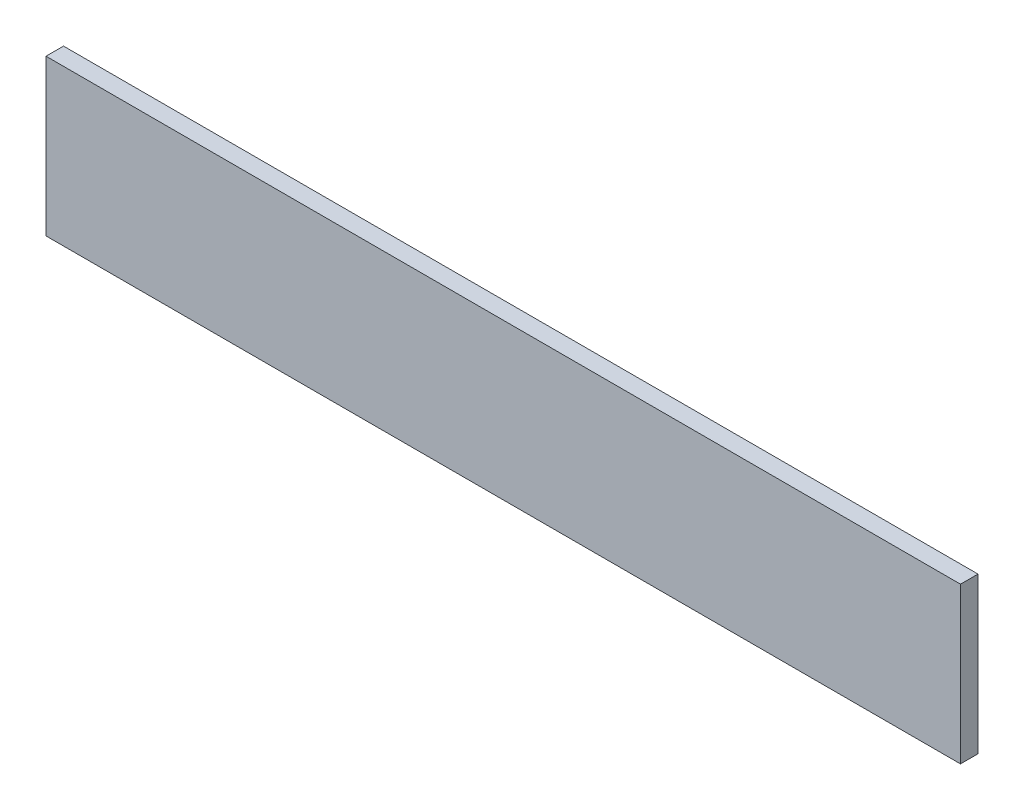
ISO-10303-21;
HEADER;
FILE_DESCRIPTION(('STEP AP214'),'2;1');
FILE_NAME('part.step','',(''),(''),'','','');
FILE_SCHEMA(('AUTOMOTIVE_DESIGN { 1 0 10303 214 1 1 1 1 }'));
ENDSEC;
DATA;
#1=APPLICATION_CONTEXT('core data for automotive mechanical design processes');
#2=APPLICATION_PROTOCOL_DEFINITION('international standard','automotive_design',2000,#1);
#3=PRODUCT_CONTEXT('',#1,'mechanical');
#4=PRODUCT('Part','Part','',(#3));
#5=PRODUCT_RELATED_PRODUCT_CATEGORY('part','',(#4));
#6=PRODUCT_DEFINITION_FORMATION('','',#4);
#7=PRODUCT_DEFINITION_CONTEXT('part definition',#1,'design');
#8=PRODUCT_DEFINITION('design','',#6,#7);
#9=PRODUCT_DEFINITION_SHAPE('','',#8);
#10=(LENGTH_UNIT() NAMED_UNIT(*) SI_UNIT(.MILLI.,.METRE.));
#11=(NAMED_UNIT(*) PLANE_ANGLE_UNIT() SI_UNIT($,.RADIAN.));
#12=(NAMED_UNIT(*) SI_UNIT($,.STERADIAN.) SOLID_ANGLE_UNIT());
#13=UNCERTAINTY_MEASURE_WITH_UNIT(LENGTH_MEASURE(1.E-05),#10,'distance_accuracy_value','');
#14=(GEOMETRIC_REPRESENTATION_CONTEXT(3) GLOBAL_UNCERTAINTY_ASSIGNED_CONTEXT((#13)) GLOBAL_UNIT_ASSIGNED_CONTEXT((#10,
#11,#12)) REPRESENTATION_CONTEXT('',''));
#15=CARTESIAN_POINT('',(0.,0.,0.));
#16=DIRECTION('',(0.,0.,1.));
#17=DIRECTION('',(1.,0.,0.));
#18=AXIS2_PLACEMENT_3D('',#15,#16,#17);
#19=CARTESIAN_POINT('',(0.,0.,-9.));
#20=DIRECTION('',(-1.,0.,0.));
#21=DIRECTION('',(0.,0.,1.));
#22=AXIS2_PLACEMENT_3D('',#19,#20,#21);
#23=PLANE('',#22);
#24=DIRECTION('',(0.,-1.,0.));
#25=VECTOR('',#24,1.);
#26=CARTESIAN_POINT('',(0.,0.,0.));
#27=LINE('',#26,#25);
#28=CARTESIAN_POINT('',(0.,80.,0.));
#29=VERTEX_POINT('',#28);
#30=CARTESIAN_POINT('',(0.,0.,0.));
#31=VERTEX_POINT('',#30);
#32=EDGE_CURVE('E99',#29,#31,#27,.T.);
#33=ORIENTED_EDGE('',*,*,#32,.F.);
#34=DIRECTION('',(0.,0.,1.));
#35=VECTOR('',#34,1.);
#36=CARTESIAN_POINT('',(0.,80.,-9.));
#37=LINE('',#36,#35);
#38=CARTESIAN_POINT('',(0.,80.,-9.));
#39=VERTEX_POINT('',#38);
#40=EDGE_CURVE('E11',#39,#29,#37,.T.);
#41=ORIENTED_EDGE('',*,*,#40,.F.);
#42=DIRECTION('',(0.,-1.,0.));
#43=VECTOR('',#42,1.);
#44=CARTESIAN_POINT('',(0.,0.,-9.));
#45=LINE('',#44,#43);
#46=CARTESIAN_POINT('',(0.,0.,-9.));
#47=VERTEX_POINT('',#46);
#48=EDGE_CURVE('E93',#39,#47,#45,.T.);
#49=ORIENTED_EDGE('',*,*,#48,.T.);
#50=DIRECTION('',(0.,0.,1.));
#51=VECTOR('',#50,1.);
#52=CARTESIAN_POINT('',(0.,0.,-9.));
#53=LINE('',#52,#51);
#54=EDGE_CURVE('E38',#47,#31,#53,.T.);
#55=ORIENTED_EDGE('',*,*,#54,.T.);
#56=EDGE_LOOP('',(#33,#41,#49,#55));
#57=FACE_BOUND('',#56,.T.);
#58=ADVANCED_FACE('F35',(#57),#23,.T.);
#59=CARTESIAN_POINT('',(0.,80.,-9.));
#60=DIRECTION('',(0.,1.,0.));
#61=DIRECTION('',(0.,0.,1.));
#62=AXIS2_PLACEMENT_3D('',#59,#60,#61);
#63=PLANE('',#62);
#64=DIRECTION('',(-1.,0.,0.));
#65=VECTOR('',#64,1.);
#66=CARTESIAN_POINT('',(0.,80.,0.));
#67=LINE('',#66,#65);
#68=CARTESIAN_POINT('',(470.,80.,0.));
#69=VERTEX_POINT('',#68);
#70=EDGE_CURVE('E95',#69,#29,#67,.T.);
#71=ORIENTED_EDGE('',*,*,#70,.F.);
#72=DIRECTION('',(0.,0.,1.));
#73=VECTOR('',#72,1.);
#74=CARTESIAN_POINT('',(470.,80.,-9.));
#75=LINE('',#74,#73);
#76=CARTESIAN_POINT('',(470.,80.,-9.));
#77=VERTEX_POINT('',#76);
#78=EDGE_CURVE('E44',#77,#69,#75,.T.);
#79=ORIENTED_EDGE('',*,*,#78,.F.);
#80=DIRECTION('',(-1.,0.,0.));
#81=VECTOR('',#80,1.);
#82=CARTESIAN_POINT('',(0.,80.,-9.));
#83=LINE('',#82,#81);
#84=EDGE_CURVE('E90',#77,#39,#83,.T.);
#85=ORIENTED_EDGE('',*,*,#84,.T.);
#86=ORIENTED_EDGE('',*,*,#40,.T.);
#87=EDGE_LOOP('',(#71,#79,#85,#86));
#88=FACE_BOUND('',#87,.T.);
#89=ADVANCED_FACE('F109',(#88),#63,.T.);
#90=CARTESIAN_POINT('',(470.,0.,-9.));
#91=DIRECTION('',(1.,0.,0.));
#92=DIRECTION('',(0.,0.,-1.));
#93=AXIS2_PLACEMENT_3D('',#90,#91,#92);
#94=PLANE('',#93);
#95=DIRECTION('',(0.,1.,0.));
#96=VECTOR('',#95,1.);
#97=CARTESIAN_POINT('',(470.,0.,0.));
#98=LINE('',#97,#96);
#99=CARTESIAN_POINT('',(470.,0.,0.));
#100=VERTEX_POINT('',#99);
#101=EDGE_CURVE('E85',#100,#69,#98,.T.);
#102=ORIENTED_EDGE('',*,*,#101,.F.);
#103=DIRECTION('',(0.,0.,1.));
#104=VECTOR('',#103,1.);
#105=CARTESIAN_POINT('',(470.,0.,-9.));
#106=LINE('',#105,#104);
#107=CARTESIAN_POINT('',(470.,0.,-9.));
#108=VERTEX_POINT('',#107);
#109=EDGE_CURVE('E80',#108,#100,#106,.T.);
#110=ORIENTED_EDGE('',*,*,#109,.F.);
#111=DIRECTION('',(0.,1.,0.));
#112=VECTOR('',#111,1.);
#113=CARTESIAN_POINT('',(470.,0.,-9.));
#114=LINE('',#113,#112);
#115=EDGE_CURVE('E83',#108,#77,#114,.T.);
#116=ORIENTED_EDGE('',*,*,#115,.T.);
#117=ORIENTED_EDGE('',*,*,#78,.T.);
#118=EDGE_LOOP('',(#102,#110,#116,#117));
#119=FACE_BOUND('',#118,.T.);
#120=ADVANCED_FACE('F82',(#119),#94,.T.);
#121=CARTESIAN_POINT('',(0.,0.,-9.));
#122=DIRECTION('',(0.,-1.,0.));
#123=DIRECTION('',(0.,0.,-1.));
#124=AXIS2_PLACEMENT_3D('',#121,#122,#123);
#125=PLANE('',#124);
#126=DIRECTION('',(1.,0.,0.));
#127=VECTOR('',#126,1.);
#128=CARTESIAN_POINT('',(0.,0.,0.));
#129=LINE('',#128,#127);
#130=EDGE_CURVE('E102',#31,#100,#129,.T.);
#131=ORIENTED_EDGE('',*,*,#130,.F.);
#132=ORIENTED_EDGE('',*,*,#54,.F.);
#133=DIRECTION('',(1.,0.,0.));
#134=VECTOR('',#133,1.);
#135=CARTESIAN_POINT('',(0.,0.,-9.));
#136=LINE('',#135,#134);
#137=EDGE_CURVE('E89',#47,#108,#136,.T.);
#138=ORIENTED_EDGE('',*,*,#137,.T.);
#139=ORIENTED_EDGE('',*,*,#109,.T.);
#140=EDGE_LOOP('',(#131,#132,#138,#139));
#141=FACE_BOUND('',#140,.T.);
#142=ADVANCED_FACE('F92',(#141),#125,.T.);
#143=CARTESIAN_POINT('',(0.,0.,-9.));
#144=DIRECTION('',(0.,0.,-1.));
#145=DIRECTION('',(-1.,0.,0.));
#146=AXIS2_PLACEMENT_3D('',#143,#144,#145);
#147=PLANE('',#146);
#148=ORIENTED_EDGE('',*,*,#48,.F.);
#149=ORIENTED_EDGE('',*,*,#84,.F.);
#150=ORIENTED_EDGE('',*,*,#115,.F.);
#151=ORIENTED_EDGE('',*,*,#137,.F.);
#152=EDGE_LOOP('',(#148,#149,#150,#151));
#153=FACE_BOUND('',#152,.T.);
#154=ADVANCED_FACE('F88',(#153),#147,.T.);
#155=CARTESIAN_POINT('',(0.,0.,0.));
#156=DIRECTION('',(0.,0.,-1.));
#157=DIRECTION('',(-1.,0.,0.));
#158=AXIS2_PLACEMENT_3D('',#155,#156,#157);
#159=PLANE('',#158);
#160=ORIENTED_EDGE('',*,*,#32,.T.);
#161=ORIENTED_EDGE('',*,*,#130,.T.);
#162=ORIENTED_EDGE('',*,*,#101,.T.);
#163=ORIENTED_EDGE('',*,*,#70,.T.);
#164=EDGE_LOOP('',(#160,#161,#162,#163));
#165=FACE_BOUND('',#164,.T.);
#166=ADVANCED_FACE('F108',(#165),#159,.F.);
#167=CLOSED_SHELL('',(#58,#89,#120,#142,#154,#166));
#168=MANIFOLD_SOLID_BREP('B2',#167);
#169=ADVANCED_BREP_SHAPE_REPRESENTATION('',(#18,#168),#14);
#170=SHAPE_DEFINITION_REPRESENTATION(#9,#169);
ENDSEC;
END-ISO-10303-21;
